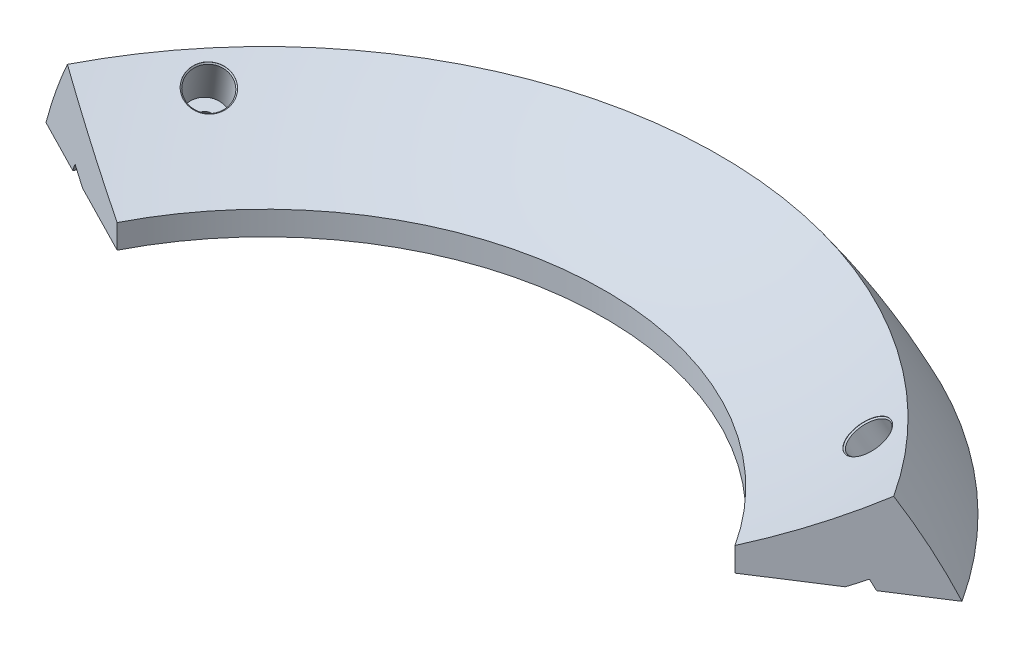
ISO-10303-21;
HEADER;
FILE_DESCRIPTION(('STEP AP214'),'2;1');
FILE_NAME('part.step','',(''),(''),'','','');
FILE_SCHEMA(('AUTOMOTIVE_DESIGN { 1 0 10303 214 1 1 1 1 }'));
ENDSEC;
DATA;
#1=APPLICATION_CONTEXT('core data for automotive mechanical design processes');
#2=APPLICATION_PROTOCOL_DEFINITION('international standard','automotive_design',2000,#1);
#3=PRODUCT_CONTEXT('',#1,'mechanical');
#4=PRODUCT('Part','Part','',(#3));
#5=PRODUCT_RELATED_PRODUCT_CATEGORY('part','',(#4));
#6=PRODUCT_DEFINITION_FORMATION('','',#4);
#7=PRODUCT_DEFINITION_CONTEXT('part definition',#1,'design');
#8=PRODUCT_DEFINITION('design','',#6,#7);
#9=PRODUCT_DEFINITION_SHAPE('','',#8);
#10=(LENGTH_UNIT() NAMED_UNIT(*) SI_UNIT(.MILLI.,.METRE.));
#11=(NAMED_UNIT(*) PLANE_ANGLE_UNIT() SI_UNIT($,.RADIAN.));
#12=(NAMED_UNIT(*) SI_UNIT($,.STERADIAN.) SOLID_ANGLE_UNIT());
#13=UNCERTAINTY_MEASURE_WITH_UNIT(LENGTH_MEASURE(1.E-05),#10,'distance_accuracy_value','');
#14=(GEOMETRIC_REPRESENTATION_CONTEXT(3) GLOBAL_UNCERTAINTY_ASSIGNED_CONTEXT((#13)) GLOBAL_UNIT_ASSIGNED_CONTEXT((#10,
#11,#12)) REPRESENTATION_CONTEXT('',''));
#15=CARTESIAN_POINT('',(0.,0.,0.));
#16=DIRECTION('',(0.,0.,1.));
#17=DIRECTION('',(1.,0.,0.));
#18=AXIS2_PLACEMENT_3D('',#15,#16,#17);
#19=CARTESIAN_POINT('',(0.860882710038676,137.731661489579,10.5935487467455));
#20=DIRECTION('',(0.,-1.,0.));
#21=DIRECTION('',(1.,0.,0.));
#22=AXIS2_PLACEMENT_3D('',#19,#20,#21);
#23=DEGENERATE_TOROIDAL_SURFACE('',#22,0.384271993012692,117.3,.F.);
#24=CARTESIAN_POINT('',(0.538042619798845,137.731661489579,10.8019695728351));
#25=DIRECTION('',(-0.542378393115804,0.,-0.840134321808792));
#26=DIRECTION('',(-0.840134321808792,0.,0.542378393115804));
#27=AXIS2_PLACEMENT_3D('',#24,#25,#26);
#28=CIRCLE('',#27,117.3);
#29=CARTESIAN_POINT('',(89.4041454900885,188.433870644681,-46.5686827455702));
#30=VERTEX_POINT('',#29);
#31=CARTESIAN_POINT('',(80.7288636364477,205.912212235372,-40.9680480500715));
#32=VERTEX_POINT('',#31);
#33=EDGE_CURVE('E140',#30,#32,#28,.F.);
#34=ORIENTED_EDGE('',*,*,#33,.F.);
#35=CARTESIAN_POINT('',(0.860882710038676,188.433870644681,10.5935487467455));
#36=DIRECTION('',(0.,-1.,0.));
#37=DIRECTION('',(0.,0.,-1.));
#38=AXIS2_PLACEMENT_3D('',#35,#36,#37);
#39=CIRCLE('',#38,105.391793290171);
#40=CARTESIAN_POINT('',(-92.9146932893387,188.433870644681,-37.5060504085806));
#41=VERTEX_POINT('',#40);
#42=EDGE_CURVE('E53',#30,#41,#39,.F.);
#43=ORIENTED_EDGE('',*,*,#42,.T.);
#44=CARTESIAN_POINT('',(1.20280048522995,137.731661489579,10.7689260532084));
#45=DIRECTION('',(0.456388468719719,0.,-0.889780627806467));
#46=DIRECTION('',(-0.889780627806467,0.,-0.456388468719719));
#47=AXIS2_PLACEMENT_3D('',#44,#45,#46);
#48=CIRCLE('',#47,117.3);
#49=CARTESIAN_POINT('',(-83.7267604389027,205.912212235368,-32.7933532860888));
#50=VERTEX_POINT('',#49);
#51=EDGE_CURVE('E134',#50,#41,#48,.F.);
#52=ORIENTED_EDGE('',*,*,#51,.F.);
#53=CARTESIAN_POINT('',(0.860882710036773,205.91221223537,10.5935487467455));
#54=DIRECTION('',(0.,-1.,0.));
#55=DIRECTION('',(1.,0.,0.));
#56=AXIS2_PLACEMENT_3D('',#53,#54,#55);
#57=CIRCLE('',#56,95.0657280069904);
#58=EDGE_CURVE('E45',#50,#32,#57,.T.);
#59=ORIENTED_EDGE('',*,*,#58,.T.);
#60=EDGE_LOOP('',(#34,#43,#52,#59));
#61=FACE_BOUND('',#60,.T.);
#62=ADVANCED_FACE('F37',(#61),#23,.F.);
#63=CARTESIAN_POINT('',(0.860882710038676,137.731661489579,10.5935487467455));
#64=DIRECTION('',(0.,-1.,0.));
#65=DIRECTION('',(1.,0.,0.));
#66=AXIS2_PLACEMENT_3D('',#63,#64,#65);
#67=DEGENERATE_TOROIDAL_SURFACE('',#66,0.384271993012692,105.8,.F.);
#68=CARTESIAN_POINT('',(0.860882710038676,188.433870644681,10.5935487467455));
#69=DIRECTION('',(0.,-1.,0.));
#70=DIRECTION('',(0.,0.,-1.));
#71=AXIS2_PLACEMENT_3D('',#68,#69,#70);
#72=CIRCLE('',#71,92.4754393289178);
#73=CARTESIAN_POINT('',(78.552673214609,188.433870644681,-39.5631314391509));
#74=VERTEX_POINT('',#73);
#75=CARTESIAN_POINT('',(-81.4219717527246,188.433870644681,-31.6111754027626));
#76=VERTEX_POINT('',#75);
#77=EDGE_CURVE('E228',#74,#76,#72,.F.);
#78=ORIENTED_EDGE('',*,*,#77,.F.);
#79=CARTESIAN_POINT('',(0.538042619798845,137.731661489579,10.8019695728351));
#80=DIRECTION('',(-0.542378393115804,0.,-0.840134321808792));
#81=DIRECTION('',(-0.840134321808792,0.,0.542378393115804));
#82=AXIS2_PLACEMENT_3D('',#79,#80,#81);
#83=CIRCLE('',#82,105.8);
#84=CARTESIAN_POINT('',(77.648295765648,190.357474429499,-38.979278625614));
#85=VERTEX_POINT('',#84);
#86=EDGE_CURVE('E126',#74,#85,#83,.F.);
#87=ORIENTED_EDGE('',*,*,#86,.T.);
#88=CARTESIAN_POINT('',(0.860882710037207,190.357474429497,10.5935487467455));
#89=DIRECTION('',(0.,-1.,0.));
#90=DIRECTION('',(1.,0.,0.));
#91=AXIS2_PLACEMENT_3D('',#88,#89,#90);
#92=CIRCLE('',#91,91.3989716433546);
#93=CARTESIAN_POINT('',(-80.4641516596523,190.357474429495,-31.1198879641222));
#94=VERTEX_POINT('',#93);
#95=EDGE_CURVE('E122',#94,#85,#92,.T.);
#96=ORIENTED_EDGE('',*,*,#95,.F.);
#97=CARTESIAN_POINT('',(1.20280048522995,137.731661489579,10.7689260532084));
#98=DIRECTION('',(0.456388468719719,0.,-0.889780627806467));
#99=DIRECTION('',(-0.889780627806467,0.,-0.456388468719719));
#100=AXIS2_PLACEMENT_3D('',#97,#98,#99);
#101=CIRCLE('',#100,105.8);
#102=EDGE_CURVE('E116',#94,#76,#101,.F.);
#103=ORIENTED_EDGE('',*,*,#102,.T.);
#104=EDGE_LOOP('',(#78,#87,#96,#103));
#105=FACE_BOUND('',#104,.T.);
#106=ADVANCED_FACE('F227',(#105),#67,.T.);
#107=CARTESIAN_POINT('',(-111.354448932281,-248.509136316921,-46.9642152398318));
#108=DIRECTION('',(0.456388468719719,0.,-0.889780627806467));
#109=DIRECTION('',(-0.889780627806467,0.,-0.456388468719719));
#110=AXIS2_PLACEMENT_3D('',#107,#108,#109);
#111=PLANE('',#110);
#112=DIRECTION('',(-0.889780627806467,0.,-0.456388468719719));
#113=VECTOR('',#112,1.);
#114=CARTESIAN_POINT('',(-111.354448932281,188.433870644681,-46.9642152398318));
#115=LINE('',#114,#113);
#116=CARTESIAN_POINT('',(-62.3914409777945,188.433870644681,-21.8499887373415));
#117=VERTEX_POINT('',#116);
#118=CARTESIAN_POINT('',(-77.2270429005849,188.433870644681,-29.4595021752409));
#119=VERTEX_POINT('',#118);
#120=EDGE_CURVE('E95',#117,#119,#115,.T.);
#121=ORIENTED_EDGE('',*,*,#120,.F.);
#122=DIRECTION('',(0.,1.,0.));
#123=VECTOR('',#122,1.);
#124=CARTESIAN_POINT('',(-62.3914409777947,171.240863683079,-21.8499887373416));
#125=LINE('',#124,#123);
#126=CARTESIAN_POINT('',(-62.3914409777947,193.435863683076,-21.8499887373416));
#127=VERTEX_POINT('',#126);
#128=EDGE_CURVE('E103',#117,#127,#125,.T.);
#129=ORIENTED_EDGE('',*,*,#128,.T.);
#130=CARTESIAN_POINT('',(-14.2821761930097,326.629858487434,2.82633371810411));
#131=DIRECTION('',(0.456388468719719,0.,-0.889780627806467));
#132=DIRECTION('',(-0.889780627806467,0.,-0.456388468719719));
#133=AXIS2_PLACEMENT_3D('',#130,#131,#132);
#134=CIRCLE('',#133,143.750000000002);
#135=EDGE_CURVE('E125',#127,#50,#134,.T.);
#136=ORIENTED_EDGE('',*,*,#135,.T.);
#137=ORIENTED_EDGE('',*,*,#51,.T.);
#138=EDGE_CURVE('E109',#76,#41,#115,.T.);
#139=ORIENTED_EDGE('',*,*,#138,.F.);
#140=ORIENTED_EDGE('',*,*,#102,.F.);
#141=CARTESIAN_POINT('',(-14.2821761930097,326.629858487434,2.82633371810411));
#142=DIRECTION('',(0.456388468719719,0.,-0.889780627806467));
#143=DIRECTION('',(-0.889780627806467,0.,-0.456388468719719));
#144=AXIS2_PLACEMENT_3D('',#141,#142,#143);
#145=CIRCLE('',#144,155.250000000002);
#146=EDGE_CURVE('E106',#119,#94,#145,.T.);
#147=ORIENTED_EDGE('',*,*,#146,.F.);
#148=EDGE_LOOP('',(#121,#129,#136,#137,#139,#140,#147));
#149=FACE_BOUND('',#148,.T.);
#150=ADVANCED_FACE('F102',(#149),#111,.F.);
#151=CARTESIAN_POINT('',(0.860882710037388,-248.509136316921,10.5935487467455));
#152=DIRECTION('',(-0.542378393115804,0.,-0.840134321808792));
#153=DIRECTION('',(-0.840134321808792,0.,0.542378393115804));
#154=AXIS2_PLACEMENT_3D('',#151,#152,#153);
#155=PLANE('',#154);
#156=DIRECTION('',(-0.840134321808792,0.,0.542378393115804));
#157=VECTOR('',#156,1.);
#158=CARTESIAN_POINT('',(0.860882710037388,188.433870644681,10.5935487467455));
#159=LINE('',#158,#157);
#160=EDGE_CURVE('E234',#30,#74,#159,.T.);
#161=ORIENTED_EDGE('',*,*,#160,.F.);
#162=ORIENTED_EDGE('',*,*,#33,.T.);
#163=CARTESIAN_POINT('',(15.1590176930147,326.629858487435,1.36288256002679));
#164=DIRECTION('',(-0.542378393115804,0.,-0.840134321808792));
#165=DIRECTION('',(-0.840134321808792,0.,0.542378393115804));
#166=AXIS2_PLACEMENT_3D('',#163,#164,#165);
#167=CIRCLE('',#166,143.750000000002);
#168=CARTESIAN_POINT('',(60.5839722038055,193.435863683076,-27.9628016732693));
#169=VERTEX_POINT('',#168);
#170=EDGE_CURVE('E137',#32,#169,#167,.T.);
#171=ORIENTED_EDGE('',*,*,#170,.T.);
#172=DIRECTION('',(0.,1.,0.));
#173=VECTOR('',#172,1.);
#174=CARTESIAN_POINT('',(60.5839722038055,171.240863683079,-27.9628016732693));
#175=LINE('',#174,#173);
#176=CARTESIAN_POINT('',(60.5839722038055,188.433870644681,-27.9628016732693));
#177=VERTEX_POINT('',#176);
#178=EDGE_CURVE('E114',#177,#169,#175,.T.);
#179=ORIENTED_EDGE('',*,*,#178,.F.);
#180=CARTESIAN_POINT('',(74.5918051128533,188.433870644681,-37.0060530998851));
#181=VERTEX_POINT('',#180);
#182=EDGE_CURVE('E60',#181,#177,#159,.T.);
#183=ORIENTED_EDGE('',*,*,#182,.F.);
#184=CARTESIAN_POINT('',(15.1590176930147,326.629858487435,1.36288256002679));
#185=DIRECTION('',(-0.542378393115804,0.,-0.840134321808792));
#186=DIRECTION('',(-0.840134321808792,0.,0.542378393115804));
#187=AXIS2_PLACEMENT_3D('',#184,#185,#186);
#188=CIRCLE('',#187,155.250000000002);
#189=EDGE_CURVE('E128',#85,#181,#188,.T.);
#190=ORIENTED_EDGE('',*,*,#189,.F.);
#191=ORIENTED_EDGE('',*,*,#86,.F.);
#192=EDGE_LOOP('',(#161,#162,#171,#179,#183,#190,#191));
#193=FACE_BOUND('',#192,.T.);
#194=ADVANCED_FACE('F233',(#193),#155,.F.);
#195=CARTESIAN_POINT('',(0.860882710033405,326.629858487434,10.5935487467455));
#196=DIRECTION('',(0.,-1.,0.));
#197=DIRECTION('',(1.,0.,0.));
#198=AXIS2_PLACEMENT_3D('',#195,#196,#197);
#199=DEGENERATE_TOROIDAL_SURFACE('',#198,17.0188678307984,155.250000000002,.T.);
#200=CARTESIAN_POINT('',(0.860882710033405,188.433870644681,10.5935487467455));
#201=DIRECTION('',(0.,-1.,0.));
#202=DIRECTION('',(0.,0.,-1.));
#203=AXIS2_PLACEMENT_3D('',#200,#201,#202);
#204=CIRCLE('',#203,87.7608740517581);
#205=EDGE_CURVE('E107',#119,#181,#204,.T.);
#206=ORIENTED_EDGE('',*,*,#205,.F.);
#207=ORIENTED_EDGE('',*,*,#146,.T.);
#208=ORIENTED_EDGE('',*,*,#95,.T.);
#209=ORIENTED_EDGE('',*,*,#189,.T.);
#210=EDGE_LOOP('',(#206,#207,#208,#209));
#211=FACE_BOUND('',#210,.T.);
#212=ADVANCED_FACE('F232',(#211),#199,.T.);
#213=CARTESIAN_POINT('',(0.860882710037388,171.240863683079,10.5935487467455));
#214=DIRECTION('',(0.,1.,0.));
#215=DIRECTION('',(0.,0.,1.));
#216=AXIS2_PLACEMENT_3D('',#213,#214,#215);
#217=CYLINDRICAL_SURFACE('',#216,71.0875486733901);
#218=CARTESIAN_POINT('',(0.860882710037388,188.433870644681,10.5935487467455));
#219=DIRECTION('',(0.,-1.,0.));
#220=DIRECTION('',(0.,0.,-1.));
#221=AXIS2_PLACEMENT_3D('',#218,#219,#220);
#222=CIRCLE('',#221,71.0875486733901);
#223=EDGE_CURVE('E11',#177,#117,#222,.F.);
#224=ORIENTED_EDGE('',*,*,#223,.F.);
#225=ORIENTED_EDGE('',*,*,#178,.T.);
#226=CARTESIAN_POINT('',(0.860882710037122,193.435863683077,10.5935487467455));
#227=DIRECTION('',(0.,-1.,0.));
#228=DIRECTION('',(1.,0.,0.));
#229=AXIS2_PLACEMENT_3D('',#226,#227,#228);
#230=CIRCLE('',#229,71.0875486733901);
#231=EDGE_CURVE('E112',#127,#169,#230,.T.);
#232=ORIENTED_EDGE('',*,*,#231,.F.);
#233=ORIENTED_EDGE('',*,*,#128,.F.);
#234=EDGE_LOOP('',(#224,#225,#232,#233));
#235=FACE_BOUND('',#234,.T.);
#236=ADVANCED_FACE('F110',(#235),#217,.F.);
#237=CARTESIAN_POINT('',(0.860882710033405,326.629858487434,10.5935487467455));
#238=DIRECTION('',(0.,-1.,0.));
#239=DIRECTION('',(1.,0.,0.));
#240=AXIS2_PLACEMENT_3D('',#237,#238,#239);
#241=DEGENERATE_TOROIDAL_SURFACE('',#240,17.0188678307984,143.750000000002,.T.);
#242=CARTESIAN_POINT('',(59.7766415142426,201.397395164591,-54.2269418669551));
#243=CARTESIAN_POINT('',(59.7188530600968,201.289922417725,-54.0217587497864));
#244=CARTESIAN_POINT('',(59.679217189762,201.186822231802,-53.8089703888772));
#245=CARTESIAN_POINT('',(59.6375146830141,200.992336462578,-53.3743295631751));
#246=CARTESIAN_POINT('',(59.6354933460613,200.90096513586,-53.1524664916995));
#247=CARTESIAN_POINT('',(59.6691665537998,200.73261345653,-52.7062552078429));
#248=CARTESIAN_POINT('',(59.7048430950835,200.655626255133,-52.4819082323122));
#249=CARTESIAN_POINT('',(59.8128896421505,200.51815359352,-52.0370972567613));
#250=CARTESIAN_POINT('',(59.8852505284959,200.457664037863,-51.8166323057878));
#251=CARTESIAN_POINT('',(60.0646338176446,200.354820680539,-51.3857750736549));
#252=CARTESIAN_POINT('',(60.1716598537659,200.312468780993,-51.1753838509958));
#253=CARTESIAN_POINT('',(60.4173541353952,200.247074884023,-50.7706803755277));
#254=CARTESIAN_POINT('',(60.556023619558,200.224033642662,-50.5763687525463));
#255=CARTESIAN_POINT('',(60.8610692865841,200.197896716706,-50.2093645673307));
#256=CARTESIAN_POINT('',(61.0274445449483,200.194800366717,-50.0366712840622));
#257=CARTESIAN_POINT('',(61.3831829284284,200.208636467739,-49.7178002180457));
#258=CARTESIAN_POINT('',(61.5725460062622,200.225568877554,-49.5716223807613));
#259=CARTESIAN_POINT('',(61.9688770973993,200.278997497927,-49.3099254330247));
#260=CARTESIAN_POINT('',(62.1758450128389,200.315493599736,-49.1944061521594));
#261=CARTESIAN_POINT('',(62.601497810327,200.407046144669,-48.9972909722889));
#262=CARTESIAN_POINT('',(62.8201826722744,200.462102555952,-48.9156950150883));
#263=CARTESIAN_POINT('',(63.263046437619,200.589258961843,-48.7887227504761));
#264=CARTESIAN_POINT('',(63.4872254094362,200.6613591688,-48.7433468943615));
#265=CARTESIAN_POINT('',(63.9346902622133,200.820608326098,-48.6900830082529));
#266=CARTESIAN_POINT('',(64.157976142162,200.907757293472,-48.682195020689));
#267=CARTESIAN_POINT('',(64.5972975709982,201.09468363769,-48.7041094787222));
#268=CARTESIAN_POINT('',(64.8133330365986,201.194461159538,-48.73391235713));
#269=CARTESIAN_POINT('',(65.2319992855513,201.403857946795,-48.8303442547627));
#270=CARTESIAN_POINT('',(65.4346300750224,201.513477207712,-48.8969732571776));
#271=CARTESIAN_POINT('',(65.8207190810302,201.7394802427,-49.0651510006742));
#272=CARTESIAN_POINT('',(66.0041774321291,201.855863969287,-49.1666994966515));
#273=CARTESIAN_POINT('',(66.3467068416037,202.092113208958,-49.4018253269368));
#274=CARTESIAN_POINT('',(66.5057778990026,202.211978722183,-49.5354026625276));
#275=CARTESIAN_POINT('',(66.79501344645,202.45179083967,-49.830790616965));
#276=CARTESIAN_POINT('',(66.9251783364739,202.571737442788,-49.992600845097));
#277=CARTESIAN_POINT('',(67.1529146413997,202.808295653996,-50.3398677499777));
#278=CARTESIAN_POINT('',(67.2504860574167,202.924907262199,-50.5253244259173));
#279=CARTESIAN_POINT('',(67.410277117475,203.151458059607,-50.9146312085009));
#280=CARTESIAN_POINT('',(67.4724967130461,203.261397239661,-51.1184813403634));
#281=CARTESIAN_POINT('',(67.5598336588017,203.471443754946,-51.5388041593971));
#282=CARTESIAN_POINT('',(67.584951003923,203.571551088835,-51.7552768482909));
#283=CARTESIAN_POINT('',(67.5973891495191,203.759048320763,-52.1947217641715));
#284=CARTESIAN_POINT('',(67.5847094263682,203.846438042601,-52.4176940811592));
#285=CARTESIAN_POINT('',(67.5219314825256,204.005970598077,-52.8638254496971));
#286=CARTESIAN_POINT('',(67.4718332654337,204.078113433182,-53.0869845012294));
#287=CARTESIAN_POINT('',(67.3356579875187,204.205060617827,-53.5271739362682));
#288=CARTESIAN_POINT('',(67.2495807462643,204.259864880413,-53.744204289034));
#289=CARTESIAN_POINT('',(67.043905591006,204.350542204571,-54.1659893300057));
#290=CARTESIAN_POINT('',(66.9243076657965,204.386415259814,-54.3707440141078));
#291=CARTESIAN_POINT('',(66.6549978462866,204.438186238238,-54.7621734131699));
#292=CARTESIAN_POINT('',(66.5052862624114,204.454084367316,-54.9488483144751));
#293=CARTESIAN_POINT('',(66.1800031368458,204.465443306533,-55.298825794387));
#294=CARTESIAN_POINT('',(66.0044316242332,204.460904139652,-55.462128399274));
#295=CARTESIAN_POINT('',(65.6324132117299,204.431520871335,-55.7607228324375));
#296=CARTESIAN_POINT('',(65.4359665310593,204.406676983109,-55.8960149548216));
#297=CARTESIAN_POINT('',(65.0277651532345,204.33740758062,-56.1347430538642));
#298=CARTESIAN_POINT('',(64.8160104279575,204.292982030381,-56.2381789719972));
#299=CARTESIAN_POINT('',(64.3831910169384,204.185840823609,-56.4102460238763));
#300=CARTESIAN_POINT('',(64.1621262981014,204.123125102053,-56.4788770338882));
#301=CARTESIAN_POINT('',(63.7169458141902,203.981224051834,-56.5793691648273));
#302=CARTESIAN_POINT('',(63.4928300427147,203.902038688612,-56.6112302085989));
#303=CARTESIAN_POINT('',(63.0478837819489,203.729489508707,-56.6372594100719));
#304=CARTESIAN_POINT('',(62.8270533965782,203.636125244575,-56.6314263780073));
#305=CARTESIAN_POINT('',(62.3949430831118,203.437921011487,-56.5822113083844));
#306=CARTESIAN_POINT('',(62.18366278061,203.333081492965,-56.5388307442041));
#307=CARTESIAN_POINT('',(61.7766451571622,203.114954990798,-56.4157444761098));
#308=CARTESIAN_POINT('',(61.5809062265633,203.001668884345,-56.3360425398552));
#309=CARTESIAN_POINT('',(61.2104392704016,202.769855972112,-56.1425315267202));
#310=CARTESIAN_POINT('',(61.0357164756566,202.651327871622,-56.0287139831388));
#311=CARTESIAN_POINT('',(60.7122262405368,202.412403122457,-55.770167009541));
#312=CARTESIAN_POINT('',(60.5634708868667,202.292005631904,-55.6254232540687));
#313=CARTESIAN_POINT('',(60.2963624887406,202.052912752546,-55.309261985712));
#314=CARTESIAN_POINT('',(60.1779730958976,201.934215490837,-55.1378767615586));
#315=CARTESIAN_POINT('',(60.0129537958312,201.745489542393,-54.8418465691));
#316=CARTESIAN_POINT('',(59.956062814622,201.673902474937,-54.7237761313022));
#317=CARTESIAN_POINT('',(59.8559649399701,201.533439355469,-54.4804412820576));
#318=CARTESIAN_POINT('',(59.8127580463284,201.464563303416,-54.3551768707155));
#319=CARTESIAN_POINT('',(59.7766415142426,201.397395164591,-54.2269418669551));
#320=B_SPLINE_CURVE_WITH_KNOTS('',3,(#242,#243,#244,#245,#246,#247,#248,#249,#250,#251,#252,
#253,#254,#255,#256,#257,#258,#259,#260,#261,#262,#263,#264,#265,#266,#267,#268,#269,#270,#271,
#272,#273,#274,#275,#276,#277,#278,#279,#280,#281,#282,#283,#284,#285,#286,#287,#288,#289,#290,
#291,#292,#293,#294,#295,#296,#297,#298,#299,#300,#301,#302,#303,#304,#305,#306,#307,#308,#309,
#310,#311,#312,#313,#314,#315,#316,#317,#318,#319),.UNSPECIFIED.,.T.,.F.,(4,2,2,2,2,2,2,2,2,2,2,
2,2,2,2,2,2,2,2,2,2,2,2,2,2,2,2,2,2,2,2,2,2,2,2,2,2,2,4),(0.,0.715632829380833,1.43212744496138,
2.1482800381896,2.86425468878428,3.5803044062943,4.29638215774935,5.01243601957244,
5.72848840861434,6.44453681745161,7.16058399790591,7.87664010006194,8.59269701267335,
9.30876214796208,10.0248269563875,10.7408867387659,11.456946549824,12.1729964521227,
12.8890463299217,13.6050971894817,14.3211481467615,15.037209023977,15.753269832306,
16.4693342316535,17.1853988703717,17.9014561279504,18.6175125803732,19.3335615138861,
20.0496117628981,20.7656645575083,21.4817188546304,22.1977957532118,22.9138445539645,
23.6298190950181,24.3459714716457,25.0624563021036,25.7780794471963,26.2253344707502,
26.6725894877956),.UNSPECIFIED.);
#321=CARTESIAN_POINT('',(59.7766415142426,201.397395164591,-54.2269418669551));
#322=VERTEX_POINT('',#321);
#323=EDGE_CURVE('E195',#322,#322,#320,.T.);
#324=ORIENTED_EDGE('',*,*,#323,.F.);
#325=EDGE_LOOP('',(#324));
#326=FACE_BOUND('',#325,.T.);
#327=CARTESIAN_POINT('',(-70.9307918638495,204.727497548179,-48.8419386353896));
#328=CARTESIAN_POINT('',(-71.0771063510751,204.722780227194,-48.6533693495705));
#329=CARTESIAN_POINT('',(-71.2096936283428,204.707798509851,-48.4541854320706));
#330=CARTESIAN_POINT('',(-71.4434912811015,204.657695988897,-48.0403026082427));
#331=CARTESIAN_POINT('',(-71.5446636838399,204.622550957792,-47.8255853092981));
#332=CARTESIAN_POINT('',(-71.7125679243802,204.533152529784,-47.386961552467));
#333=CARTESIAN_POINT('',(-71.7793161904524,204.478908268466,-47.1630595329934));
#334=CARTESIAN_POINT('',(-71.8765009259178,204.352898903406,-46.7123929837912));
#335=CARTESIAN_POINT('',(-71.9069464089579,204.281138154179,-46.4856291787545));
#336=CARTESIAN_POINT('',(-71.9306792950452,204.122160004272,-46.0355715765949));
#337=CARTESIAN_POINT('',(-71.9239624654763,204.034940844044,-45.8122781776398));
#338=CARTESIAN_POINT('',(-71.8735279557625,203.847570172018,-45.3755016918679));
#339=CARTESIAN_POINT('',(-71.829808822368,203.747418152418,-45.1620189907093));
#340=CARTESIAN_POINT('',(-71.7065897018365,203.537074126082,-44.7509189644684));
#341=CARTESIAN_POINT('',(-71.6270902001425,203.426882255576,-44.5533014241815));
#342=CARTESIAN_POINT('',(-71.4345497792577,203.199624322274,-44.1795243925636));
#343=CARTESIAN_POINT('',(-71.3215089299107,203.082558273792,-44.0033648565512));
#344=CARTESIAN_POINT('',(-71.0650832884493,202.844903884955,-43.6774952592461));
#345=CARTESIAN_POINT('',(-70.9216987698421,202.724315576357,-43.5277849595715));
#346=CARTESIAN_POINT('',(-70.6086497099281,202.483052558879,-43.2590570947648));
#347=CARTESIAN_POINT('',(-70.4389852179889,202.362377850162,-43.1400394719768));
#348=CARTESIAN_POINT('',(-70.0781956207262,202.124365823554,-42.9360773539069));
#349=CARTESIAN_POINT('',(-69.8870707392274,202.007028470871,-42.8511325032997));
#350=CARTESIAN_POINT('',(-69.4887929540335,201.779001015835,-42.7177325579044));
#351=CARTESIAN_POINT('',(-69.2816400327,201.668310920796,-42.6692775032729));
#352=CARTESIAN_POINT('',(-68.8572008936705,201.456685109704,-42.6102452810921));
#353=CARTESIAN_POINT('',(-68.6399146156925,201.355749451689,-42.5996683389033));
#354=CARTESIAN_POINT('',(-68.2013984162359,201.166452665718,-42.6167101526017));
#355=CARTESIAN_POINT('',(-67.9801684959619,201.07809153392,-42.6443288968208));
#356=CARTESIAN_POINT('',(-67.5400648390081,200.916398880558,-42.7369981000265));
#357=CARTESIAN_POINT('',(-67.3211911357276,200.843067571776,-42.8020490889064));
#358=CARTESIAN_POINT('',(-66.8920394192079,200.71346589942,-42.9677560889013));
#359=CARTESIAN_POINT('',(-66.681761407003,200.657195537898,-43.0684121043004));
#360=CARTESIAN_POINT('',(-66.275790897893,200.563267788168,-43.3024888458571));
#361=CARTESIAN_POINT('',(-66.0800983861223,200.52561038099,-43.4359095386203));
#362=CARTESIAN_POINT('',(-65.7088688999928,200.469944314389,-43.7317407364474));
#363=CARTESIAN_POINT('',(-65.5333319225567,200.451935651965,-43.8941512370851));
#364=CARTESIAN_POINT('',(-65.2074066947145,200.436061761841,-44.2433551733098));
#365=CARTESIAN_POINT('',(-65.0570180616944,200.43819622765,-44.4301482378566));
#366=CARTESIAN_POINT('',(-64.7856544998585,200.462549267702,-44.8228158942648));
#367=CARTESIAN_POINT('',(-64.6646795715355,200.484767842283,-45.0286904864458));
#368=CARTESIAN_POINT('',(-64.4555687690228,200.548678619338,-45.4536682849403));
#369=CARTESIAN_POINT('',(-64.3674327373472,200.59037072842,-45.6727714278075));
#370=CARTESIAN_POINT('',(-64.2264843173509,200.692081197387,-46.1179741343108));
#371=CARTESIAN_POINT('',(-64.1736719277722,200.752099556619,-46.3440736976977));
#372=CARTESIAN_POINT('',(-64.1048480277679,200.888807040264,-46.7968366690275));
#373=CARTESIAN_POINT('',(-64.0888370089989,200.965496387384,-47.0235000844627));
#374=CARTESIAN_POINT('',(-64.0940481704005,201.133420916318,-47.4709342506097));
#375=CARTESIAN_POINT('',(-64.115270367935,201.224656104916,-47.6917049985733));
#376=CARTESIAN_POINT('',(-64.1943230815419,201.419134587258,-48.1210700403618));
#377=CARTESIAN_POINT('',(-64.2521539662272,201.522378001904,-48.3296642115577));
#378=CARTESIAN_POINT('',(-64.402763147039,201.737985081853,-48.7287357234786));
#379=CARTESIAN_POINT('',(-64.4955414040105,201.850348736937,-48.9192130845013));
#380=CARTESIAN_POINT('',(-64.7133965096624,202.081037094611,-49.2766304768038));
#381=CARTESIAN_POINT('',(-64.8384730481385,202.199361739941,-49.4435707341187));
#382=CARTESIAN_POINT('',(-65.117367625299,202.438630422532,-49.7491712435597));
#383=CARTESIAN_POINT('',(-65.2711857134003,202.559574464296,-49.8878314470617));
#384=CARTESIAN_POINT('',(-65.6031945217736,202.800645989678,-50.1329336548888));
#385=CARTESIAN_POINT('',(-65.7813848873995,202.920773485151,-50.2393761279485));
#386=CARTESIAN_POINT('',(-66.1570895629425,203.156787189132,-50.4170305093257));
#387=CARTESIAN_POINT('',(-66.3546039121888,203.272673389009,-50.4882423459379));
#388=CARTESIAN_POINT('',(-66.7633676282238,203.496886735461,-50.5934264860092));
#389=CARTESIAN_POINT('',(-66.9746173021904,203.605213712869,-50.6273979563179));
#390=CARTESIAN_POINT('',(-67.4048610735832,203.811186195345,-50.6571484005065));
#391=CARTESIAN_POINT('',(-67.6238548674506,203.908832118483,-50.6529288697712));
#392=CARTESIAN_POINT('',(-68.0633777658865,204.090621457246,-50.6064417044579));
#393=CARTESIAN_POINT('',(-68.2839067291834,204.174766098606,-50.5641775261301));
#394=CARTESIAN_POINT('',(-68.7203422660611,204.327148441889,-50.4428013966523));
#395=CARTESIAN_POINT('',(-68.9362476773801,204.39538218581,-50.3636802915974));
#396=CARTESIAN_POINT('',(-69.3573482382416,204.513963662053,-50.1708254735758));
#397=CARTESIAN_POINT('',(-69.5625381938598,204.564302788017,-50.0570751544931));
#398=CARTESIAN_POINT('',(-69.9561217121872,204.645539611509,-49.7982909975189));
#399=CARTESIAN_POINT('',(-70.1445351793499,204.676460618707,-49.6532949493117));
#400=CARTESIAN_POINT('',(-70.4327086750978,204.71024719649,-49.3958017876037));
#401=CARTESIAN_POINT('',(-70.5392177717087,204.719285319433,-49.2915081172652));
#402=CARTESIAN_POINT('',(-70.7425359420259,204.729384662771,-49.0735046320482));
#403=CARTESIAN_POINT('',(-70.8393450158422,204.730445883257,-48.9597948172765));
#404=CARTESIAN_POINT('',(-70.9307918638495,204.727497548179,-48.8419386353896));
#405=B_SPLINE_CURVE_WITH_KNOTS('',3,(#327,#328,#329,#330,#331,#332,#333,#334,#335,#336,#337,
#338,#339,#340,#341,#342,#343,#344,#345,#346,#347,#348,#349,#350,#351,#352,#353,#354,#355,#356,
#357,#358,#359,#360,#361,#362,#363,#364,#365,#366,#367,#368,#369,#370,#371,#372,#373,#374,#375,
#376,#377,#378,#379,#380,#381,#382,#383,#384,#385,#386,#387,#388,#389,#390,#391,#392,#393,#394,
#395,#396,#397,#398,#399,#400,#401,#402,#403,#404),.UNSPECIFIED.,.T.,.F.,(4,2,2,2,2,2,2,2,2,2,2,
2,2,2,2,2,2,2,2,2,2,2,2,2,2,2,2,2,2,2,2,2,2,2,2,2,2,2,4),(0.,0.71562370133402,1.43210907596753,
2.14825220432181,2.86421748388161,3.5802643102642,4.29633926038434,5.0124044955959,
5.72846823973958,6.44452552980728,7.16058147475958,7.87662995218042,8.59267921760056,
9.30873274323711,10.0247860501299,10.7408494937685,11.4569130235644,12.1729758235356,
12.8890385141782,13.605090309452,14.3211421167259,15.0371904899773,15.7532388377283,
16.4692967516414,17.1853549994903,17.9014204574415,18.6174851131168,19.3335428917049,
20.0496019014557,20.7656504927877,21.4817005414941,22.1977666095182,22.9138046397938,
23.6297776265727,24.3459285295872,25.0624233984833,25.7780565286043,26.225322782478,
26.6725890312767),.UNSPECIFIED.);
#406=CARTESIAN_POINT('',(-70.9307918638495,204.727497548179,-48.8419386353896));
#407=VERTEX_POINT('',#406);
#408=EDGE_CURVE('E146',#407,#407,#405,.T.);
#409=ORIENTED_EDGE('',*,*,#408,.F.);
#410=EDGE_LOOP('',(#409));
#411=FACE_BOUND('',#410,.T.);
#412=ORIENTED_EDGE('',*,*,#170,.F.);
#413=ORIENTED_EDGE('',*,*,#58,.F.);
#414=ORIENTED_EDGE('',*,*,#135,.F.);
#415=ORIENTED_EDGE('',*,*,#231,.T.);
#416=EDGE_LOOP('',(#412,#413,#414,#415));
#417=FACE_BOUND('',#416,.T.);
#418=ADVANCED_FACE('F213',(#326,#411,#417),#241,.F.);
#419=CARTESIAN_POINT('',(-111.925737568352,188.433870644681,-21.8499887373415));
#420=DIRECTION('',(0.,-1.,0.));
#421=DIRECTION('',(0.,0.,-1.));
#422=AXIS2_PLACEMENT_3D('',#419,#420,#421);
#423=PLANE('',#422);
#424=ORIENTED_EDGE('',*,*,#205,.T.);
#425=ORIENTED_EDGE('',*,*,#182,.T.);
#426=ORIENTED_EDGE('',*,*,#223,.T.);
#427=ORIENTED_EDGE('',*,*,#120,.T.);
#428=EDGE_LOOP('',(#424,#425,#426,#427));
#429=FACE_BOUND('',#428,.T.);
#430=ADVANCED_FACE('F94',(#429),#423,.T.);
#431=CARTESIAN_POINT('',(69.2900018521684,188.433870644681,-58.3777880674813));
#432=DIRECTION('',(0.,-1.,0.));
#433=DIRECTION('',(-0.704310871194247,0.,0.709891679566398));
#434=AXIS2_PLACEMENT_3D('',#431,#432,#433);
#435=ELLIPSE('',#434,1.96515454835961,1.69999999999999);
#436=CARTESIAN_POINT('',(67.905922140182,188.433870644681,-56.9827412045387));
#437=VERTEX_POINT('',#436);
#438=EDGE_CURVE('E40',#437,#437,#435,.T.);
#439=ORIENTED_EDGE('',*,*,#438,.F.);
#440=EDGE_LOOP('',(#439));
#441=FACE_BOUND('',#440,.T.);
#442=CARTESIAN_POINT('',(-74.3682232347801,188.433870644681,-51.9121233730816));
#443=DIRECTION('',(0.,-1.,0.));
#444=DIRECTION('',(0.769151948922539,0.,0.639065942973541));
#445=AXIS2_PLACEMENT_3D('',#442,#443,#444);
#446=ELLIPSE('',#445,1.96917973739607,1.69999999999999);
#447=CARTESIAN_POINT('',(-72.8536248019831,188.433870644681,-50.6536876673182));
#448=VERTEX_POINT('',#447);
#449=EDGE_CURVE('E144',#448,#448,#446,.T.);
#450=ORIENTED_EDGE('',*,*,#449,.F.);
#451=EDGE_LOOP('',(#450));
#452=FACE_BOUND('',#451,.T.);
#453=ORIENTED_EDGE('',*,*,#138,.T.);
#454=ORIENTED_EDGE('',*,*,#42,.F.);
#455=ORIENTED_EDGE('',*,*,#160,.T.);
#456=ORIENTED_EDGE('',*,*,#77,.T.);
#457=EDGE_LOOP('',(#453,#454,#455,#456));
#458=FACE_BOUND('',#457,.T.);
#459=ADVANCED_FACE('F173',(#441,#452,#458),#423,.T.);
#460=CARTESIAN_POINT('',(-68.0299985632066,202.529962800335,-46.645877175316));
#461=DIRECTION('',(0.388179380262436,0.863303622171114,0.322526936371687));
#462=DIRECTION('',(-0.912042935673211,0.41009472501922,0.));
#463=AXIS2_PLACEMENT_3D('',#460,#461,#462);
#464=CYLINDRICAL_SURFACE('',#463,4.25);
#465=CARTESIAN_POINT('',(-68.0299985632066,202.529962800335,-46.645877175316));
#466=DIRECTION('',(0.388179380262436,0.863303622171114,0.322526936371687));
#467=DIRECTION('',(-0.912042935673211,0.41009472501922,0.));
#468=AXIS2_PLACEMENT_3D('',#465,#466,#467);
#469=CIRCLE('',#468,4.25);
#470=CARTESIAN_POINT('',(-71.9061810398177,204.272865381666,-46.645877175316));
#471=VERTEX_POINT('',#470);
#472=EDGE_CURVE('E201',#471,#471,#469,.T.);
#473=ORIENTED_EDGE('',*,*,#472,.F.);
#474=EDGE_LOOP('',(#473));
#475=FACE_BOUND('',#474,.T.);
#476=ORIENTED_EDGE('',*,*,#408,.T.);
#477=EDGE_LOOP('',(#476));
#478=FACE_BOUND('',#477,.T.);
#479=ADVANCED_FACE('F168',(#475,#478),#464,.F.);
#480=CARTESIAN_POINT('',(-68.0299985632066,202.529962800335,-46.645877175316));
#481=DIRECTION('',(0.388179380262436,0.863303622171114,0.322526936371687));
#482=DIRECTION('',(-0.912042935673211,0.41009472501922,0.));
#483=AXIS2_PLACEMENT_3D('',#480,#481,#482);
#484=CYLINDRICAL_SURFACE('',#483,1.69999999999999);
#485=ORIENTED_EDGE('',*,*,#449,.T.);
#486=EDGE_LOOP('',(#485));
#487=FACE_BOUND('',#486,.T.);
#488=CARTESIAN_POINT('',(-72.6881511263558,192.170319334281,-50.5162004117763));
#489=DIRECTION('',(0.388179380262436,0.863303622171114,0.322526936371687));
#490=DIRECTION('',(-0.912042935673211,0.41009472501922,0.));
#491=AXIS2_PLACEMENT_3D('',#488,#489,#490);
#492=CIRCLE('',#491,1.7);
#493=CARTESIAN_POINT('',(-74.2386241170003,192.867480366814,-50.5162004117763));
#494=VERTEX_POINT('',#493);
#495=EDGE_CURVE('E147',#494,#494,#492,.T.);
#496=ORIENTED_EDGE('',*,*,#495,.T.);
#497=EDGE_LOOP('',(#496));
#498=FACE_BOUND('',#497,.T.);
#499=ADVANCED_FACE('F172',(#487,#498),#484,.F.);
#500=CARTESIAN_POINT('',(-70.2437243051901,190.157968710774,-48.0717735906105));
#501=DIRECTION('',(-0.388179380262436,-0.863303622171114,-0.322526936371687));
#502=DIRECTION('',(0.912042935673211,-0.41009472501922,0.));
#503=AXIS2_PLACEMENT_3D('',#500,#501,#502);
#504=PLANE('',#503);
#505=ORIENTED_EDGE('',*,*,#495,.F.);
#506=EDGE_LOOP('',(#505));
#507=FACE_BOUND('',#506,.T.);
#508=CARTESIAN_POINT('',(-72.6881511263558,192.170319334281,-50.5162004117763));
#509=DIRECTION('',(0.388179380262436,0.863303622171114,0.322526936371687));
#510=DIRECTION('',(-0.912042935673211,0.41009472501922,0.));
#511=AXIS2_PLACEMENT_3D('',#508,#509,#510);
#512=CIRCLE('',#511,4.);
#513=CARTESIAN_POINT('',(-76.3363228690487,193.810698234358,-50.5162004117763));
#514=VERTEX_POINT('',#513);
#515=EDGE_CURVE('E153',#514,#514,#512,.T.);
#516=ORIENTED_EDGE('',*,*,#515,.T.);
#517=EDGE_LOOP('',(#516));
#518=FACE_BOUND('',#517,.T.);
#519=ADVANCED_FACE('F177',(#507,#518),#504,.F.);
#520=CARTESIAN_POINT('',(-68.0299985632066,202.529962800335,-46.645877175316));
#521=DIRECTION('',(0.388179380262436,0.863303622171114,0.322526936371687));
#522=DIRECTION('',(-0.912042935673211,0.41009472501922,0.));
#523=AXIS2_PLACEMENT_3D('',#520,#521,#522);
#524=CYLINDRICAL_SURFACE('',#523,4.);
#525=CARTESIAN_POINT('',(-68.1270434082722,202.314136894792,-46.7265089094089));
#526=DIRECTION('',(0.388179380262436,0.863303622171114,0.322526936371687));
#527=DIRECTION('',(-0.912042935673211,0.41009472501922,0.));
#528=AXIS2_PLACEMENT_3D('',#525,#526,#527);
#529=CIRCLE('',#528,3.99999999999999);
#530=CARTESIAN_POINT('',(-71.7752151509651,203.954515794869,-46.7265089094089));
#531=VERTEX_POINT('',#530);
#532=EDGE_CURVE('E158',#531,#531,#529,.T.);
#533=CARTESIAN_POINT('',(-76.3363228690487,193.810698234358,-50.5162004117763));
#534=CARTESIAN_POINT('',(-76.2888113303186,193.916363000613,-50.4767244586266));
#535=CARTESIAN_POINT('',(-76.2412997915886,194.022027766869,-50.437248505477));
#536=CARTESIAN_POINT('',(-76.1462767141285,194.233357299379,-50.3582965991776));
#537=CARTESIAN_POINT('',(-76.0987651753985,194.339022065635,-50.318820646028));
#538=CARTESIAN_POINT('',(-76.0037420979384,194.550351598145,-50.2398687397286));
#539=CARTESIAN_POINT('',(-75.9562305592084,194.656016364401,-50.200392786579));
#540=CARTESIAN_POINT('',(-75.8612074817483,194.867345896911,-50.1214408802797));
#541=CARTESIAN_POINT('',(-75.8136959430182,194.973010663167,-50.08196492713));
#542=CARTESIAN_POINT('',(-75.7186728655582,195.184340195677,-50.0030130208307));
#543=CARTESIAN_POINT('',(-75.6711613268281,195.290004961933,-49.963537067681));
#544=CARTESIAN_POINT('',(-75.5761382493681,195.501334494443,-49.8845851613817));
#545=CARTESIAN_POINT('',(-75.528626710638,195.606999260699,-49.8451092082321));
#546=CARTESIAN_POINT('',(-75.433603633178,195.818328793209,-49.7661573019327));
#547=CARTESIAN_POINT('',(-75.3860920944479,195.923993559464,-49.7266813487831));
#548=CARTESIAN_POINT('',(-75.2910690169878,196.135323091975,-49.6477294424838));
#549=CARTESIAN_POINT('',(-75.2435574782578,196.24098785823,-49.6082534893341));
#550=CARTESIAN_POINT('',(-75.1485344007977,196.452317390741,-49.5293015830348));
#551=CARTESIAN_POINT('',(-75.1010228620677,196.557982156996,-49.4898256298851));
#552=CARTESIAN_POINT('',(-75.0059997846076,196.769311689507,-49.4108737235858));
#553=CARTESIAN_POINT('',(-74.9584882458776,196.874976455762,-49.3713977704361));
#554=CARTESIAN_POINT('',(-74.8634651684175,197.086305988273,-49.2924458641368));
#555=CARTESIAN_POINT('',(-74.8159536296875,197.191970754528,-49.2529699109872));
#556=CARTESIAN_POINT('',(-74.7209305522274,197.403300287039,-49.1740180046878));
#557=CARTESIAN_POINT('',(-74.6734190134974,197.508965053294,-49.1345420515382));
#558=CARTESIAN_POINT('',(-74.5783959360373,197.720294585805,-49.0555901452389));
#559=CARTESIAN_POINT('',(-74.5308843973072,197.82595935206,-49.0161141920892));
#560=CARTESIAN_POINT('',(-74.4358613198472,198.037288884571,-48.9371622857899));
#561=CARTESIAN_POINT('',(-74.3883497811171,198.142953650826,-48.8976863326402));
#562=CARTESIAN_POINT('',(-74.2933267036571,198.354283183337,-48.8187344263409));
#563=CARTESIAN_POINT('',(-74.245815164927,198.459947949592,-48.7792584731912));
#564=CARTESIAN_POINT('',(-74.1507920874669,198.671277482103,-48.7003065668919));
#565=CARTESIAN_POINT('',(-74.1032805487369,198.776942248358,-48.6608306137423));
#566=CARTESIAN_POINT('',(-74.0082574712768,198.988271780869,-48.5818787074429));
#567=CARTESIAN_POINT('',(-73.9607459325468,199.093936547124,-48.5424027542933));
#568=CARTESIAN_POINT('',(-73.8657228550867,199.305266079635,-48.463450847994));
#569=CARTESIAN_POINT('',(-73.8182113163567,199.41093084589,-48.4239748948443));
#570=CARTESIAN_POINT('',(-73.7231882388966,199.622260378401,-48.345022988545));
#571=CARTESIAN_POINT('',(-73.6756767001666,199.727925144656,-48.3055470353953));
#572=CARTESIAN_POINT('',(-73.5806536227065,199.939254677167,-48.226595129096));
#573=CARTESIAN_POINT('',(-73.5331420839764,200.044919443422,-48.1871191759463));
#574=CARTESIAN_POINT('',(-73.4381190065164,200.256248975933,-48.108167269647));
#575=CARTESIAN_POINT('',(-73.3906074677863,200.361913742188,-48.0686913164974));
#576=CARTESIAN_POINT('',(-73.2955843903263,200.573243274699,-47.9897394101981));
#577=CARTESIAN_POINT('',(-73.2480728515962,200.678908040954,-47.9502634570484));
#578=CARTESIAN_POINT('',(-73.1530497741361,200.890237573464,-47.8713115507491));
#579=CARTESIAN_POINT('',(-73.1055382354061,200.99590233972,-47.8318355975994));
#580=CARTESIAN_POINT('',(-73.010515157946,201.20723187223,-47.7528836913001));
#581=CARTESIAN_POINT('',(-72.963003619216,201.312896638486,-47.7134077381504));
#582=CARTESIAN_POINT('',(-72.8679805417559,201.524226170996,-47.6344558318511));
#583=CARTESIAN_POINT('',(-72.8204690030259,201.629890937252,-47.5949798787015));
#584=CARTESIAN_POINT('',(-72.7254459255658,201.841220469762,-47.5160279724021));
#585=CARTESIAN_POINT('',(-72.6779343868358,201.946885236018,-47.4765520192525));
#586=CARTESIAN_POINT('',(-72.5829113093757,202.158214768528,-47.3976001129532));
#587=CARTESIAN_POINT('',(-72.5353997706456,202.263879534784,-47.3581241598035));
#588=CARTESIAN_POINT('',(-72.4403766931856,202.475209067294,-47.2791722535042));
#589=CARTESIAN_POINT('',(-72.3928651544555,202.58087383355,-47.2396963003545));
#590=CARTESIAN_POINT('',(-72.2978420769955,202.79220336606,-47.1607443940552));
#591=CARTESIAN_POINT('',(-72.2503305382654,202.897868132316,-47.1212684409055));
#592=CARTESIAN_POINT('',(-72.1553074608054,203.109197664826,-47.0423165346062));
#593=CARTESIAN_POINT('',(-72.1077959220753,203.214862431082,-47.0028405814566));
#594=CARTESIAN_POINT('',(-72.0127728446152,203.426191963592,-46.9238886751572));
#595=CARTESIAN_POINT('',(-71.9652613058852,203.531856729847,-46.8844127220076));
#596=CARTESIAN_POINT('',(-71.8702382284251,203.743186262358,-46.8054608157083));
#597=CARTESIAN_POINT('',(-71.8227266896951,203.848851028613,-46.7659848625586));
#598=CARTESIAN_POINT('',(-71.7752151509651,203.954515794869,-46.7265089094089));
#599=B_SPLINE_CURVE_WITH_KNOTS('',3,(#533,#534,#535,#536,#537,#538,#539,#540,#541,#542,#543,
#544,#545,#546,#547,#548,#549,#550,#551,#552,#553,#554,#555,#556,#557,#558,#559,#560,#561,#562,
#563,#564,#565,#566,#567,#568,#569,#570,#571,#572,#573,#574,#575,#576,#577,#578,#579,#580,#581,
#582,#583,#584,#585,#586,#587,#588,#589,#590,#591,#592,#593,#594,#595,#596,#597,#598),
.UNSPECIFIED.,.F.,.F.,(4,2,2,2,2,2,2,2,2,2,2,2,2,2,2,2,2,2,2,2,2,2,2,2,2,2,2,2,2,2,2,2,4),(0.,
0.367187500000017,0.734375000000007,1.10156250000002,1.46875000000001,1.8359375,
2.20312500000001,2.5703125,2.93750000000002,3.3046875,3.67187500000002,4.03906250000001,
4.40625000000002,4.77343750000001,5.140625,5.50781250000001,5.875,6.24218750000001,6.609375,
6.97656250000002,7.34375000000001,7.71093750000002,8.07812500000001,8.4453125,8.81250000000001,
9.1796875,9.54687500000002,9.91406250000001,10.28125,10.6484375,11.015625,11.3828125,11.75),.UNSPECIFIED.);
#600=EDGE_CURVE('BSEAM180',#514,#531,#599,.T.);
#601=ORIENTED_EDGE('',*,*,#515,.F.);
#602=ORIENTED_EDGE('',*,*,#532,.T.);
#603=ORIENTED_EDGE('',*,*,#600,.T.);
#604=ORIENTED_EDGE('',*,*,#600,.F.);
#605=EDGE_LOOP('',(#601,#603,#602,#604));
#606=FACE_BOUND('',#605,.T.);
#607=ADVANCED_FACE('F180',(#606),#524,.F.);
#608=CARTESIAN_POINT('',(-68.0299985632066,202.529962800335,-46.645877175316));
#609=DIRECTION('',(0.388179380262436,0.863303622171114,0.322526936371687));
#610=DIRECTION('',(-0.912042935673211,0.41009472501922,0.));
#611=AXIS2_PLACEMENT_3D('',#608,#609,#610);
#612=CONICAL_SURFACE('',#611,4.25,0.785398163397476);
#613=CARTESIAN_POINT('',(-71.7752151509651,203.954515794869,-46.7265089094089));
#614=CARTESIAN_POINT('',(-71.7765793789739,203.957831936398,-46.7256689955121));
#615=CARTESIAN_POINT('',(-71.7779436069828,203.961148077927,-46.7248290816153));
#616=CARTESIAN_POINT('',(-71.7806720630006,203.967780360985,-46.7231492538217));
#617=CARTESIAN_POINT('',(-71.7820362910095,203.971096502514,-46.7223093399249));
#618=CARTESIAN_POINT('',(-71.7847647470272,203.977728785573,-46.7206295121313));
#619=CARTESIAN_POINT('',(-71.7861289750361,203.981044927102,-46.7197895982345));
#620=CARTESIAN_POINT('',(-71.7888574310539,203.98767721016,-46.7181097704409));
#621=CARTESIAN_POINT('',(-71.7902216590628,203.990993351689,-46.7172698565441));
#622=CARTESIAN_POINT('',(-71.7929501150805,203.997625634748,-46.7155900287505));
#623=CARTESIAN_POINT('',(-71.7943143430894,204.000941776277,-46.7147501148537));
#624=CARTESIAN_POINT('',(-71.7970427991072,204.007574059335,-46.7130702870601));
#625=CARTESIAN_POINT('',(-71.7984070271161,204.010890200864,-46.7122303731633));
#626=CARTESIAN_POINT('',(-71.8011354831338,204.017522483922,-46.7105505453697));
#627=CARTESIAN_POINT('',(-71.8024997111427,204.020838625452,-46.7097106314729));
#628=CARTESIAN_POINT('',(-71.8052281671605,204.02747090851,-46.7080308036793));
#629=CARTESIAN_POINT('',(-71.8065923951693,204.030787050039,-46.7071908897825));
#630=CARTESIAN_POINT('',(-71.8093208511871,204.037419333097,-46.7055110619889));
#631=CARTESIAN_POINT('',(-71.810685079196,204.040735474626,-46.7046711480921));
#632=CARTESIAN_POINT('',(-71.8134135352137,204.047367757685,-46.7029913202985));
#633=CARTESIAN_POINT('',(-71.8147777632226,204.050683899214,-46.7021514064017));
#634=CARTESIAN_POINT('',(-71.8175062192404,204.057316182272,-46.7004715786081));
#635=CARTESIAN_POINT('',(-71.8188704472493,204.060632323801,-46.6996316647113));
#636=CARTESIAN_POINT('',(-71.821598903267,204.06726460686,-46.6979518369177));
#637=CARTESIAN_POINT('',(-71.8229631312759,204.070580748389,-46.6971119230209));
#638=CARTESIAN_POINT('',(-71.8256915872937,204.077213031447,-46.6954320952273));
#639=CARTESIAN_POINT('',(-71.8270558153026,204.080529172976,-46.6945921813305));
#640=CARTESIAN_POINT('',(-71.8297842713203,204.087161456034,-46.6929123535369));
#641=CARTESIAN_POINT('',(-71.8311484993292,204.090477597564,-46.6920724396401));
#642=CARTESIAN_POINT('',(-71.833876955347,204.097109880622,-46.6903926118465));
#643=CARTESIAN_POINT('',(-71.8352411833559,204.100426022151,-46.6895526979497));
#644=CARTESIAN_POINT('',(-71.8379696393736,204.107058305209,-46.6878728701561));
#645=CARTESIAN_POINT('',(-71.8393338673825,204.110374446738,-46.6870329562593));
#646=CARTESIAN_POINT('',(-71.8420623234003,204.117006729797,-46.6853531284657));
#647=CARTESIAN_POINT('',(-71.8434265514092,204.120322871326,-46.6845132145689));
#648=CARTESIAN_POINT('',(-71.8461550074269,204.126955154384,-46.6828333867753));
#649=CARTESIAN_POINT('',(-71.8475192354358,204.130271295913,-46.6819934728785));
#650=CARTESIAN_POINT('',(-71.8502476914536,204.136903578971,-46.6803136450849));
#651=CARTESIAN_POINT('',(-71.8516119194625,204.140219720501,-46.6794737311881));
#652=CARTESIAN_POINT('',(-71.8543403754802,204.146852003559,-46.6777939033945));
#653=CARTESIAN_POINT('',(-71.8557046034891,204.150168145088,-46.6769539894977));
#654=CARTESIAN_POINT('',(-71.8584330595069,204.156800428146,-46.6752741617041));
#655=CARTESIAN_POINT('',(-71.8597972875157,204.160116569675,-46.6744342478073));
#656=CARTESIAN_POINT('',(-71.8625257435335,204.166748852734,-46.6727544200137));
#657=CARTESIAN_POINT('',(-71.8638899715424,204.170064994263,-46.6719145061169));
#658=CARTESIAN_POINT('',(-71.8666184275602,204.176697277321,-46.6702346783233));
#659=CARTESIAN_POINT('',(-71.867982655569,204.18001341885,-46.6693947644265));
#660=CARTESIAN_POINT('',(-71.8707111115868,204.186645701909,-46.6677149366329));
#661=CARTESIAN_POINT('',(-71.8720753395957,204.189961843438,-46.6668750227361));
#662=CARTESIAN_POINT('',(-71.8748037956134,204.196594126496,-46.6651951949425));
#663=CARTESIAN_POINT('',(-71.8761680236223,204.199910268025,-46.6643552810457));
#664=CARTESIAN_POINT('',(-71.8788964796401,204.206542551083,-46.6626754532521));
#665=CARTESIAN_POINT('',(-71.880260707649,204.209858692613,-46.6618355393553));
#666=CARTESIAN_POINT('',(-71.8829891636667,204.216490975671,-46.6601557115617));
#667=CARTESIAN_POINT('',(-71.8843533916756,204.2198071172,-46.6593157976649));
#668=CARTESIAN_POINT('',(-71.8870818476934,204.226439400258,-46.6576359698713));
#669=CARTESIAN_POINT('',(-71.8884460757023,204.229755541787,-46.6567960559744));
#670=CARTESIAN_POINT('',(-71.89117453172,204.236387824846,-46.6551162281808));
#671=CARTESIAN_POINT('',(-71.8925387597289,204.239703966375,-46.654276314284));
#672=CARTESIAN_POINT('',(-71.8952672157467,204.246336249433,-46.6525964864904));
#673=CARTESIAN_POINT('',(-71.8966314437556,204.249652390962,-46.6517565725936));
#674=CARTESIAN_POINT('',(-71.8993598997733,204.256284674021,-46.6500767448));
#675=CARTESIAN_POINT('',(-71.9007241277822,204.25960081555,-46.6492368309032));
#676=CARTESIAN_POINT('',(-71.9034525838,204.266233098608,-46.6475570031096));
#677=CARTESIAN_POINT('',(-71.9048168118089,204.269549240137,-46.6467170892128));
#678=CARTESIAN_POINT('',(-71.9061810398177,204.272865381666,-46.645877175316));
#679=B_SPLINE_CURVE_WITH_KNOTS('',3,(#613,#614,#615,#616,#617,#618,#619,#620,#621,#622,#623,
#624,#625,#626,#627,#628,#629,#630,#631,#632,#633,#634,#635,#636,#637,#638,#639,#640,#641,#642,
#643,#644,#645,#646,#647,#648,#649,#650,#651,#652,#653,#654,#655,#656,#657,#658,#659,#660,#661,
#662,#663,#664,#665,#666,#667,#668,#669,#670,#671,#672,#673,#674,#675,#676,#677,#678),
.UNSPECIFIED.,.F.,.F.,(4,2,2,2,2,2,2,2,2,2,2,2,2,2,2,2,2,2,2,2,2,2,2,2,2,2,2,2,2,2,2,2,4),(0.,
0.0110485434560418,0.0220970869120886,0.0331456303681304,0.0441941738241824,0.0552427172802242,
0.0662912607362461,0.0773398041922878,0.0883883476483347,0.0994368911043781,0.11048543456043,
0.121533978016447,0.132582521472489,0.143631064928536,0.154679608384577,0.165728151840599,
0.176776695296646,0.187825238752668,0.19887378220871,0.209922325664757,0.220970869120798,
0.232019412576847,0.243067956032869,0.25411649948891,0.265165042944957,0.276213586400999,
0.287262129857046,0.298310673313088,0.309359216769115,0.320407760225157,0.331456303681203,
0.342504847137245,0.353553390593262),.UNSPECIFIED.);
#680=EDGE_CURVE('BSEAM184',#531,#471,#679,.T.);
#681=ORIENTED_EDGE('',*,*,#532,.F.);
#682=ORIENTED_EDGE('',*,*,#472,.T.);
#683=ORIENTED_EDGE('',*,*,#680,.T.);
#684=ORIENTED_EDGE('',*,*,#680,.F.);
#685=EDGE_LOOP('',(#681,#683,#682,#684));
#686=FACE_BOUND('',#685,.T.);
#687=ADVANCED_FACE('F184',(#686),#612,.F.);
#688=CARTESIAN_POINT('',(63.6366386744391,202.275771322132,-52.6796288517474));
#689=DIRECTION('',(-0.353316051031346,0.865071910715139,0.35611565168534));
#690=DIRECTION('',(0.,-0.380667153485278,0.924712127236047));
#691=AXIS2_PLACEMENT_3D('',#688,#689,#690);
#692=CYLINDRICAL_SURFACE('',#691,4.25);
#693=CARTESIAN_POINT('',(63.6366386744391,202.275771322132,-52.6796288517474));
#694=DIRECTION('',(-0.353316051031346,0.865071910715139,0.35611565168534));
#695=DIRECTION('',(0.,-0.380667153485278,0.924712127236047));
#696=AXIS2_PLACEMENT_3D('',#693,#694,#695);
#697=CIRCLE('',#696,4.25);
#698=CARTESIAN_POINT('',(63.6366386744391,200.657935919819,-48.7496023109942));
#699=VERTEX_POINT('',#698);
#700=EDGE_CURVE('E374',#699,#699,#697,.T.);
#701=ORIENTED_EDGE('',*,*,#700,.F.);
#702=EDGE_LOOP('',(#701));
#703=FACE_BOUND('',#702,.T.);
#704=ORIENTED_EDGE('',*,*,#323,.T.);
#705=EDGE_LOOP('',(#704));
#706=FACE_BOUND('',#705,.T.);
#707=ADVANCED_FACE('F188',(#703,#706),#692,.F.);
#708=CARTESIAN_POINT('',(63.6366386744391,202.275771322132,-52.6796288517474));
#709=DIRECTION('',(-0.353316051031346,0.865071910715139,0.35611565168534));
#710=DIRECTION('',(0.,-0.380667153485278,0.924712127236047));
#711=AXIS2_PLACEMENT_3D('',#708,#709,#710);
#712=CYLINDRICAL_SURFACE('',#711,1.69999999999999);
#713=ORIENTED_EDGE('',*,*,#438,.T.);
#714=EDGE_LOOP('',(#713));
#715=FACE_BOUND('',#714,.T.);
#716=CARTESIAN_POINT('',(67.8764312868153,191.89490839355,-56.9530166719715));
#717=DIRECTION('',(-0.353316051031346,0.865071910715139,0.35611565168534));
#718=DIRECTION('',(0.,-0.380667153485278,0.924712127236047));
#719=AXIS2_PLACEMENT_3D('',#716,#717,#718);
#720=CIRCLE('',#719,1.7);
#721=CARTESIAN_POINT('',(67.8764312868153,191.247774232625,-55.3810060556702));
#722=VERTEX_POINT('',#721);
#723=EDGE_CURVE('E202',#722,#722,#720,.T.);
#724=ORIENTED_EDGE('',*,*,#723,.T.);
#725=EDGE_LOOP('',(#724));
#726=FACE_BOUND('',#725,.T.);
#727=ADVANCED_FACE('F326',(#715,#726),#712,.F.);
#728=CARTESIAN_POINT('',(70.7048510057774,191.885754882036,-54.1245969530094));
#729=DIRECTION('',(0.353316051031346,-0.865071910715139,-0.35611565168534));
#730=DIRECTION('',(0.,0.380667153485278,-0.924712127236047));
#731=AXIS2_PLACEMENT_3D('',#728,#729,#730);
#732=PLANE('',#731);
#733=ORIENTED_EDGE('',*,*,#723,.F.);
#734=EDGE_LOOP('',(#733));
#735=FACE_BOUND('',#734,.T.);
#736=CARTESIAN_POINT('',(67.8764312868153,191.89490839355,-56.9530166719715));
#737=DIRECTION('',(-0.353316051031346,0.865071910715139,0.35611565168534));
#738=DIRECTION('',(0.,-0.380667153485278,0.924712127236047));
#739=AXIS2_PLACEMENT_3D('',#736,#737,#738);
#740=CIRCLE('',#739,4.);
#741=CARTESIAN_POINT('',(67.8764312868153,190.372239779609,-53.2541681630273));
#742=VERTEX_POINT('',#741);
#743=EDGE_CURVE('E376',#742,#742,#740,.T.);
#744=ORIENTED_EDGE('',*,*,#743,.T.);
#745=EDGE_LOOP('',(#744));
#746=FACE_BOUND('',#745,.T.);
#747=ADVANCED_FACE('F335',(#735,#746),#732,.F.);
#748=CARTESIAN_POINT('',(63.6366386744391,202.275771322132,-52.6796288517474));
#749=DIRECTION('',(-0.353316051031346,0.865071910715139,0.35611565168534));
#750=DIRECTION('',(0.,-0.380667153485278,0.924712127236047));
#751=AXIS2_PLACEMENT_3D('',#748,#749,#750);
#752=CYLINDRICAL_SURFACE('',#751,4.);
#753=ORIENTED_EDGE('',*,*,#743,.F.);
#754=EDGE_LOOP('',(#753));
#755=FACE_BOUND('',#754,.T.);
#756=CARTESIAN_POINT('',(63.724967687197,202.059503344453,-52.7686577646687));
#757=DIRECTION('',(-0.353316051031346,0.865071910715139,0.35611565168534));
#758=DIRECTION('',(0.,-0.380667153485278,0.924712127236047));
#759=AXIS2_PLACEMENT_3D('',#756,#757,#758);
#760=CIRCLE('',#759,4.);
#761=CARTESIAN_POINT('',(63.724967687197,200.536834730512,-49.0698092557245));
#762=VERTEX_POINT('',#761);
#763=EDGE_CURVE('E371',#762,#762,#760,.T.);
#764=ORIENTED_EDGE('',*,*,#763,.T.);
#765=EDGE_LOOP('',(#764));
#766=FACE_BOUND('',#765,.T.);
#767=ADVANCED_FACE('F344',(#755,#766),#752,.F.);
#768=CARTESIAN_POINT('',(63.6366386744391,202.275771322132,-52.6796288517474));
#769=DIRECTION('',(-0.353316051031346,0.865071910715139,0.35611565168534));
#770=DIRECTION('',(0.,-0.380667153485278,0.924712127236047));
#771=AXIS2_PLACEMENT_3D('',#768,#769,#770);
#772=CONICAL_SURFACE('',#771,4.25,0.78539816339749);
#773=ORIENTED_EDGE('',*,*,#763,.F.);
#774=EDGE_LOOP('',(#773));
#775=FACE_BOUND('',#774,.T.);
#776=ORIENTED_EDGE('',*,*,#700,.T.);
#777=EDGE_LOOP('',(#776));
#778=FACE_BOUND('',#777,.T.);
#779=ADVANCED_FACE('F354',(#775,#778),#772,.F.);
#780=CLOSED_SHELL('',(#62,#106,#150,#194,#212,#236,#418,#430,#459,#479,#499,#519,#607,#687,#707,
#727,#747,#767,#779));
#781=MANIFOLD_SOLID_BREP('B2',#780);
#782=ADVANCED_BREP_SHAPE_REPRESENTATION('',(#18,#781),#14);
#783=SHAPE_DEFINITION_REPRESENTATION(#9,#782);
ENDSEC;
END-ISO-10303-21;
